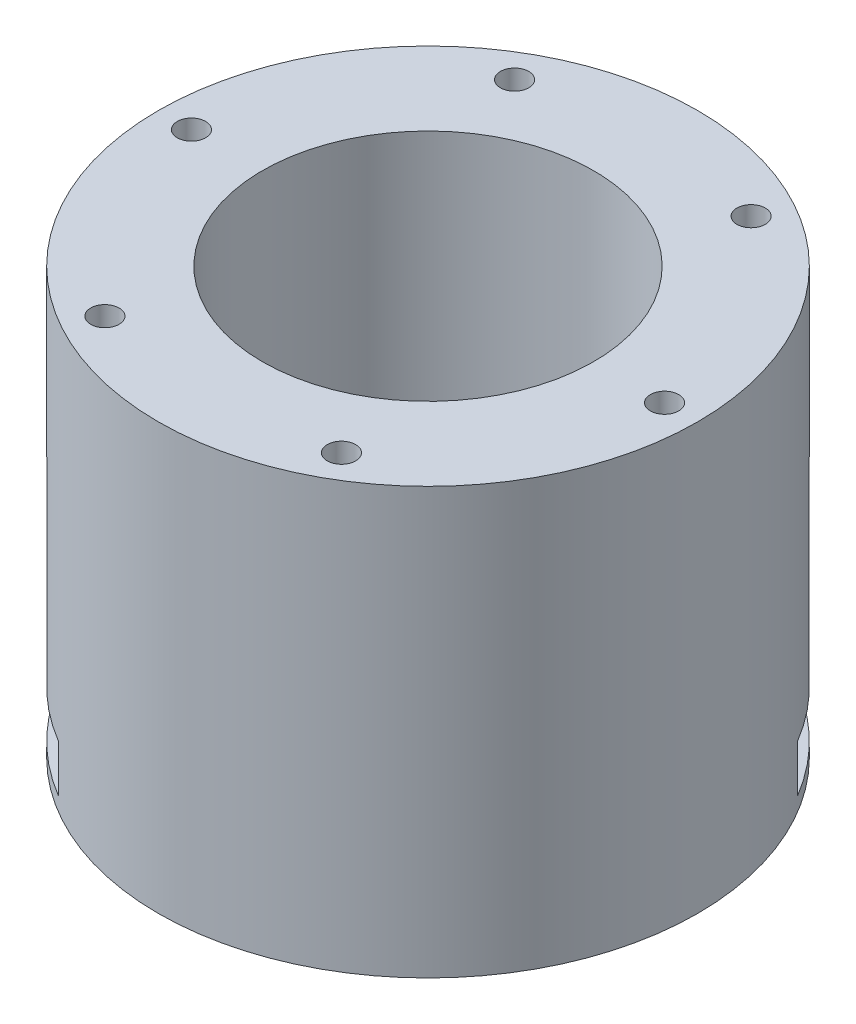
ISO-10303-21;
HEADER;
FILE_DESCRIPTION(('STEP AP214'),'2;1');
FILE_NAME('part.step','',(''),(''),'','','');
FILE_SCHEMA(('AUTOMOTIVE_DESIGN { 1 0 10303 214 1 1 1 1 }'));
ENDSEC;
DATA;
#1=APPLICATION_CONTEXT('core data for automotive mechanical design processes');
#2=APPLICATION_PROTOCOL_DEFINITION('international standard','automotive_design',2000,#1);
#3=PRODUCT_CONTEXT('',#1,'mechanical');
#4=PRODUCT('Part','Part','',(#3));
#5=PRODUCT_RELATED_PRODUCT_CATEGORY('part','',(#4));
#6=PRODUCT_DEFINITION_FORMATION('','',#4);
#7=PRODUCT_DEFINITION_CONTEXT('part definition',#1,'design');
#8=PRODUCT_DEFINITION('design','',#6,#7);
#9=PRODUCT_DEFINITION_SHAPE('','',#8);
#10=(LENGTH_UNIT() NAMED_UNIT(*) SI_UNIT(.MILLI.,.METRE.));
#11=(NAMED_UNIT(*) PLANE_ANGLE_UNIT() SI_UNIT($,.RADIAN.));
#12=(NAMED_UNIT(*) SI_UNIT($,.STERADIAN.) SOLID_ANGLE_UNIT());
#13=UNCERTAINTY_MEASURE_WITH_UNIT(LENGTH_MEASURE(1.E-05),#10,'distance_accuracy_value','');
#14=(GEOMETRIC_REPRESENTATION_CONTEXT(3) GLOBAL_UNCERTAINTY_ASSIGNED_CONTEXT((#13)) GLOBAL_UNIT_ASSIGNED_CONTEXT((#10,
#11,#12)) REPRESENTATION_CONTEXT('',''));
#15=CARTESIAN_POINT('',(0.,0.,0.));
#16=DIRECTION('',(0.,0.,1.));
#17=DIRECTION('',(1.,0.,0.));
#18=AXIS2_PLACEMENT_3D('',#15,#16,#17);
#19=CARTESIAN_POINT('',(-36.7695526217003,6.5,26.870057685089));
#20=DIRECTION('',(0.707106781186551,0.,0.707106781186544));
#21=DIRECTION('',(0.707106781186544,0.,-0.707106781186551));
#22=AXIS2_PLACEMENT_3D('',#19,#20,#21);
#23=PLANE('',#22);
#24=DIRECTION('',(0.707106781186544,0.,-0.707106781186551));
#25=VECTOR('',#24,1.);
#26=CARTESIAN_POINT('',(-36.7695526217003,6.5,26.870057685089));
#27=LINE('',#26,#25);
#28=CARTESIAN_POINT('',(-1.7677669529664,6.5,-8.13172798364529));
#29=VERTEX_POINT('',#28);
#30=CARTESIAN_POINT('',(14.5854771272803,6.5,-24.4849720638922));
#31=VERTEX_POINT('',#30);
#32=EDGE_CURVE('E166',#29,#31,#27,.T.);
#33=ORIENTED_EDGE('',*,*,#32,.F.);
#34=DIRECTION('',(0.,-1.,0.));
#35=VECTOR('',#34,1.);
#36=CARTESIAN_POINT('',(-1.7677669529664,6.5,-8.13172798364529));
#37=LINE('',#36,#35);
#38=CARTESIAN_POINT('',(-1.7677669529664,1.5,-8.13172798364531));
#39=VERTEX_POINT('',#38);
#40=EDGE_CURVE('E144',#29,#39,#37,.T.);
#41=ORIENTED_EDGE('',*,*,#40,.T.);
#42=DIRECTION('',(0.707106781186544,0.,-0.707106781186551));
#43=VECTOR('',#42,1.);
#44=CARTESIAN_POINT('',(-36.7695526217003,1.5,26.870057685089));
#45=LINE('',#44,#43);
#46=CARTESIAN_POINT('',(14.5854771272803,1.50000000000001,-24.4849720638922));
#47=VERTEX_POINT('',#46);
#48=EDGE_CURVE('E170',#39,#47,#45,.T.);
#49=ORIENTED_EDGE('',*,*,#48,.T.);
#50=DIRECTION('',(0.,-1.,0.));
#51=VECTOR('',#50,1.);
#52=CARTESIAN_POINT('',(14.5854771272804,45.,-24.4849720638922));
#53=LINE('',#52,#51);
#54=EDGE_CURVE('E216',#47,#31,#53,.F.);
#55=ORIENTED_EDGE('',*,*,#54,.T.);
#56=EDGE_LOOP('',(#33,#41,#49,#55));
#57=FACE_BOUND('',#56,.T.);
#58=ADVANCED_FACE('F35',(#57),#23,.T.);
#59=CARTESIAN_POINT('',(0.,45.,0.));
#60=DIRECTION('',(0.,-1.,0.));
#61=DIRECTION('',(0.,0.,-1.));
#62=AXIS2_PLACEMENT_3D('',#59,#60,#61);
#63=CYLINDRICAL_SURFACE('',#62,28.5);
#64=CARTESIAN_POINT('',(0.,8.50000000000001,0.));
#65=DIRECTION('',(0.,-1.,0.));
#66=DIRECTION('',(0.,0.,-1.));
#67=AXIS2_PLACEMENT_3D('',#64,#65,#66);
#68=CIRCLE('',#67,28.5);
#69=CARTESIAN_POINT('',(-23.0817292574719,8.50000000000001,-16.7177682267929));
#70=VERTEX_POINT('',#69);
#71=CARTESIAN_POINT('',(-16.717768226793,8.5,-23.0817292574718));
#72=VERTEX_POINT('',#71);
#73=EDGE_CURVE('E11',#70,#72,#68,.T.);
#74=ORIENTED_EDGE('',*,*,#73,.F.);
#75=DIRECTION('',(0.,-1.,0.));
#76=VECTOR('',#75,1.);
#77=CARTESIAN_POINT('',(-23.0817292574719,45.,-16.7177682267929));
#78=LINE('',#77,#76);
#79=CARTESIAN_POINT('',(-23.0817292574719,1.50000000000001,-16.7177682267929));
#80=VERTEX_POINT('',#79);
#81=EDGE_CURVE('E155',#70,#80,#78,.T.);
#82=ORIENTED_EDGE('',*,*,#81,.T.);
#83=CARTESIAN_POINT('',(0.,1.50000000000001,0.));
#84=DIRECTION('',(0.,-1.,0.));
#85=DIRECTION('',(0.,0.,-1.));
#86=AXIS2_PLACEMENT_3D('',#83,#84,#85);
#87=CIRCLE('',#86,28.5);
#88=CARTESIAN_POINT('',(-16.717768226793,1.50000000000001,-23.0817292574718));
#89=VERTEX_POINT('',#88);
#90=EDGE_CURVE('E158',#80,#89,#87,.T.);
#91=ORIENTED_EDGE('',*,*,#90,.T.);
#92=DIRECTION('',(0.,-1.,0.));
#93=VECTOR('',#92,1.);
#94=CARTESIAN_POINT('',(-16.717768226793,45.,-23.0817292574718));
#95=LINE('',#94,#93);
#96=EDGE_CURVE('E148',#72,#89,#95,.T.);
#97=ORIENTED_EDGE('',*,*,#96,.F.);
#98=EDGE_LOOP('',(#74,#82,#91,#97));
#99=FACE_BOUND('',#98,.T.);
#100=DIRECTION('',(0.,-1.,0.));
#101=VECTOR('',#100,1.);
#102=CARTESIAN_POINT('',(-24.484972063892,45.,14.5854771272806));
#103=LINE('',#102,#101);
#104=CARTESIAN_POINT('',(-24.4849720638921,6.5,14.5854771272806));
#105=VERTEX_POINT('',#104);
#106=CARTESIAN_POINT('',(-24.4849720638921,1.50000000000001,14.5854771272806));
#107=VERTEX_POINT('',#106);
#108=EDGE_CURVE('E225',#105,#107,#103,.T.);
#109=ORIENTED_EDGE('',*,*,#108,.F.);
#110=CARTESIAN_POINT('',(0.,6.50000000000001,0.));
#111=DIRECTION('',(0.,1.,0.));
#112=DIRECTION('',(-1.,0.,0.));
#113=AXIS2_PLACEMENT_3D('',#110,#111,#112);
#114=CIRCLE('',#113,28.5);
#115=CARTESIAN_POINT('',(-14.5854771272803,6.5,24.4849720638922));
#116=VERTEX_POINT('',#115);
#117=EDGE_CURVE('E43',#105,#116,#114,.T.);
#118=ORIENTED_EDGE('',*,*,#117,.T.);
#119=DIRECTION('',(0.,-1.,0.));
#120=VECTOR('',#119,1.);
#121=CARTESIAN_POINT('',(-14.5854771272803,45.,24.4849720638922));
#122=LINE('',#121,#120);
#123=CARTESIAN_POINT('',(-14.5854771272803,1.5,24.4849720638922));
#124=VERTEX_POINT('',#123);
#125=EDGE_CURVE('E223',#116,#124,#122,.T.);
#126=ORIENTED_EDGE('',*,*,#125,.T.);
#127=CARTESIAN_POINT('',(0.,1.50000000000001,0.));
#128=DIRECTION('',(0.,1.,0.));
#129=DIRECTION('',(-1.,0.,0.));
#130=AXIS2_PLACEMENT_3D('',#127,#128,#129);
#131=CIRCLE('',#130,28.5);
#132=EDGE_CURVE('E217',#107,#124,#131,.T.);
#133=ORIENTED_EDGE('',*,*,#132,.F.);
#134=EDGE_LOOP('',(#109,#118,#126,#133));
#135=FACE_BOUND('',#134,.T.);
#136=DIRECTION('',(0.,-1.,0.));
#137=VECTOR('',#136,1.);
#138=CARTESIAN_POINT('',(24.4849720638921,45.,-14.5854771272806));
#139=LINE('',#138,#137);
#140=CARTESIAN_POINT('',(24.484972063892,1.5,-14.5854771272806));
#141=VERTEX_POINT('',#140);
#142=CARTESIAN_POINT('',(24.4849720638921,6.5,-14.5854771272806));
#143=VERTEX_POINT('',#142);
#144=EDGE_CURVE('E208',#141,#143,#139,.F.);
#145=ORIENTED_EDGE('',*,*,#144,.T.);
#146=EDGE_CURVE('E220',#143,#31,#114,.T.);
#147=ORIENTED_EDGE('',*,*,#146,.T.);
#148=ORIENTED_EDGE('',*,*,#54,.F.);
#149=EDGE_CURVE('E213',#141,#47,#131,.T.);
#150=ORIENTED_EDGE('',*,*,#149,.F.);
#151=EDGE_LOOP('',(#145,#147,#148,#150));
#152=FACE_BOUND('',#151,.T.);
#153=CARTESIAN_POINT('',(0.,45.,0.));
#154=DIRECTION('',(0.,1.,0.));
#155=DIRECTION('',(0.,0.,1.));
#156=AXIS2_PLACEMENT_3D('',#153,#154,#155);
#157=CIRCLE('',#156,28.5);
#158=CARTESIAN_POINT('',(0.,45.,28.5));
#159=VERTEX_POINT('',#158);
#160=EDGE_CURVE('E205',#159,#159,#157,.T.);
#161=ORIENTED_EDGE('',*,*,#160,.F.);
#162=EDGE_LOOP('',(#161));
#163=FACE_BOUND('',#162,.T.);
#164=CARTESIAN_POINT('',(0.,0.,0.));
#165=DIRECTION('',(0.,1.,0.));
#166=DIRECTION('',(0.,0.,1.));
#167=AXIS2_PLACEMENT_3D('',#164,#165,#166);
#168=CIRCLE('',#167,28.5);
#169=CARTESIAN_POINT('',(0.,0.,28.5));
#170=VERTEX_POINT('',#169);
#171=EDGE_CURVE('E202',#170,#170,#168,.T.);
#172=ORIENTED_EDGE('',*,*,#171,.T.);
#173=EDGE_LOOP('',(#172));
#174=FACE_BOUND('',#173,.T.);
#175=ADVANCED_FACE('F37',(#99,#135,#152,#163,#174),#63,.T.);
#176=CARTESIAN_POINT('',(0.,45.,0.));
#177=DIRECTION('',(0.,1.,0.));
#178=DIRECTION('',(0.,0.,1.));
#179=AXIS2_PLACEMENT_3D('',#176,#177,#178);
#180=PLANE('',#179);
#181=CARTESIAN_POINT('',(-12.4999999999996,45.,-21.6506350946112));
#182=DIRECTION('',(0.,1.,0.));
#183=DIRECTION('',(0.,0.,1.));
#184=AXIS2_PLACEMENT_3D('',#181,#182,#183);
#185=CIRCLE('',#184,1.5);
#186=CARTESIAN_POINT('',(-12.4999999999996,45.,-20.1506350946112));
#187=VERTEX_POINT('',#186);
#188=EDGE_CURVE('E392',#187,#187,#185,.T.);
#189=ORIENTED_EDGE('',*,*,#188,.F.);
#190=EDGE_LOOP('',(#189));
#191=FACE_BOUND('',#190,.T.);
#192=CARTESIAN_POINT('',(12.5000000000001,45.,-21.6506350946109));
#193=DIRECTION('',(0.,1.,0.));
#194=DIRECTION('',(0.,0.,1.));
#195=AXIS2_PLACEMENT_3D('',#192,#193,#194);
#196=CIRCLE('',#195,1.5);
#197=CARTESIAN_POINT('',(12.5000000000001,45.,-20.1506350946109));
#198=VERTEX_POINT('',#197);
#199=EDGE_CURVE('E401',#198,#198,#196,.T.);
#200=ORIENTED_EDGE('',*,*,#199,.F.);
#201=EDGE_LOOP('',(#200));
#202=FACE_BOUND('',#201,.T.);
#203=CARTESIAN_POINT('',(25.,45.,1.74574066942157E-13));
#204=DIRECTION('',(0.,1.,0.));
#205=DIRECTION('',(0.,0.,1.));
#206=AXIS2_PLACEMENT_3D('',#203,#204,#205);
#207=CIRCLE('',#206,1.5);
#208=CARTESIAN_POINT('',(25.,45.,1.50000000000018));
#209=VERTEX_POINT('',#208);
#210=EDGE_CURVE('E407',#209,#209,#207,.T.);
#211=ORIENTED_EDGE('',*,*,#210,.F.);
#212=EDGE_LOOP('',(#211));
#213=FACE_BOUND('',#212,.T.);
#214=CARTESIAN_POINT('',(12.4999999999998,45.,21.6506350946111));
#215=DIRECTION('',(0.,1.,0.));
#216=DIRECTION('',(0.,0.,1.));
#217=AXIS2_PLACEMENT_3D('',#214,#215,#216);
#218=CIRCLE('',#217,1.5);
#219=CARTESIAN_POINT('',(12.4999999999998,45.,23.1506350946111));
#220=VERTEX_POINT('',#219);
#221=EDGE_CURVE('E413',#220,#220,#218,.T.);
#222=ORIENTED_EDGE('',*,*,#221,.F.);
#223=EDGE_LOOP('',(#222));
#224=FACE_BOUND('',#223,.T.);
#225=CARTESIAN_POINT('',(-12.5000000000003,45.,21.6506350946108));
#226=DIRECTION('',(0.,1.,0.));
#227=DIRECTION('',(0.,0.,1.));
#228=AXIS2_PLACEMENT_3D('',#225,#226,#227);
#229=CIRCLE('',#228,1.5);
#230=CARTESIAN_POINT('',(-12.5000000000003,45.,23.1506350946108));
#231=VERTEX_POINT('',#230);
#232=EDGE_CURVE('E419',#231,#231,#229,.T.);
#233=ORIENTED_EDGE('',*,*,#232,.F.);
#234=EDGE_LOOP('',(#233));
#235=FACE_BOUND('',#234,.T.);
#236=CARTESIAN_POINT('',(-25.,45.,0.));
#237=DIRECTION('',(0.,1.,0.));
#238=DIRECTION('',(0.,0.,1.));
#239=AXIS2_PLACEMENT_3D('',#236,#237,#238);
#240=CIRCLE('',#239,1.5);
#241=CARTESIAN_POINT('',(-25.,45.,1.5));
#242=VERTEX_POINT('',#241);
#243=EDGE_CURVE('E391',#242,#242,#240,.T.);
#244=ORIENTED_EDGE('',*,*,#243,.F.);
#245=EDGE_LOOP('',(#244));
#246=FACE_BOUND('',#245,.T.);
#247=CARTESIAN_POINT('',(0.,45.,0.));
#248=DIRECTION('',(0.,1.,0.));
#249=DIRECTION('',(0.,0.,1.));
#250=AXIS2_PLACEMENT_3D('',#247,#248,#249);
#251=CIRCLE('',#250,17.5);
#252=CARTESIAN_POINT('',(0.,45.,17.5));
#253=VERTEX_POINT('',#252);
#254=EDGE_CURVE('E196',#253,#253,#251,.T.);
#255=ORIENTED_EDGE('',*,*,#254,.F.);
#256=EDGE_LOOP('',(#255));
#257=FACE_BOUND('',#256,.T.);
#258=ORIENTED_EDGE('',*,*,#160,.T.);
#259=EDGE_LOOP('',(#258));
#260=FACE_BOUND('',#259,.T.);
#261=ADVANCED_FACE('F265',(#191,#202,#213,#224,#235,#246,#257,#260),#180,.T.);
#262=CARTESIAN_POINT('',(0.,0.,0.));
#263=DIRECTION('',(0.,1.,0.));
#264=DIRECTION('',(0.,0.,1.));
#265=AXIS2_PLACEMENT_3D('',#262,#263,#264);
#266=PLANE('',#265);
#267=CARTESIAN_POINT('',(0.,0.,19.));
#268=DIRECTION('',(0.,-1.,0.));
#269=DIRECTION('',(0.,0.,-1.));
#270=AXIS2_PLACEMENT_3D('',#267,#268,#269);
#271=CIRCLE('',#270,1.5);
#272=CARTESIAN_POINT('',(0.,0.,17.5));
#273=VERTEX_POINT('',#272);
#274=EDGE_CURVE('E179',#273,#273,#271,.T.);
#275=ORIENTED_EDGE('',*,*,#274,.F.);
#276=EDGE_LOOP('',(#275));
#277=FACE_BOUND('',#276,.T.);
#278=CARTESIAN_POINT('',(19.,0.,-1.32676290876039E-13));
#279=DIRECTION('',(0.,-1.,0.));
#280=DIRECTION('',(0.,0.,-1.));
#281=AXIS2_PLACEMENT_3D('',#278,#279,#280);
#282=CIRCLE('',#281,1.5);
#283=CARTESIAN_POINT('',(19.,0.,-1.50000000000013));
#284=VERTEX_POINT('',#283);
#285=EDGE_CURVE('E185',#284,#284,#282,.T.);
#286=ORIENTED_EDGE('',*,*,#285,.F.);
#287=EDGE_LOOP('',(#286));
#288=FACE_BOUND('',#287,.T.);
#289=CARTESIAN_POINT('',(-1.99014436314059E-13,0.,-19.));
#290=DIRECTION('',(0.,-1.,0.));
#291=DIRECTION('',(0.,0.,-1.));
#292=AXIS2_PLACEMENT_3D('',#289,#290,#291);
#293=CIRCLE('',#292,1.5);
#294=CARTESIAN_POINT('',(-1.99014436314059E-13,0.,-20.5));
#295=VERTEX_POINT('',#294);
#296=EDGE_CURVE('E165',#295,#295,#293,.T.);
#297=ORIENTED_EDGE('',*,*,#296,.F.);
#298=EDGE_LOOP('',(#297));
#299=FACE_BOUND('',#298,.T.);
#300=CARTESIAN_POINT('',(-19.,0.,0.));
#301=DIRECTION('',(0.,-1.,0.));
#302=DIRECTION('',(0.,0.,-1.));
#303=AXIS2_PLACEMENT_3D('',#300,#301,#302);
#304=CIRCLE('',#303,1.5);
#305=CARTESIAN_POINT('',(-19.,0.,-1.5));
#306=VERTEX_POINT('',#305);
#307=EDGE_CURVE('E178',#306,#306,#304,.T.);
#308=ORIENTED_EDGE('',*,*,#307,.F.);
#309=EDGE_LOOP('',(#308));
#310=FACE_BOUND('',#309,.T.);
#311=ORIENTED_EDGE('',*,*,#171,.F.);
#312=EDGE_LOOP('',(#311));
#313=FACE_BOUND('',#312,.T.);
#314=ADVANCED_FACE('F269',(#277,#288,#299,#310,#313),#266,.F.);
#315=CARTESIAN_POINT('',(0.,15.,0.));
#316=DIRECTION('',(0.,1.,0.));
#317=DIRECTION('',(0.,0.,1.));
#318=AXIS2_PLACEMENT_3D('',#315,#316,#317);
#319=CYLINDRICAL_SURFACE('',#318,17.5);
#320=CARTESIAN_POINT('',(0.,15.,0.));
#321=DIRECTION('',(0.,1.,0.));
#322=DIRECTION('',(0.,0.,1.));
#323=AXIS2_PLACEMENT_3D('',#320,#321,#322);
#324=CIRCLE('',#323,17.5);
#325=CARTESIAN_POINT('',(0.,15.,17.5));
#326=VERTEX_POINT('',#325);
#327=EDGE_CURVE('E199',#326,#326,#324,.T.);
#328=ORIENTED_EDGE('',*,*,#327,.F.);
#329=EDGE_LOOP('',(#328));
#330=FACE_BOUND('',#329,.T.);
#331=ORIENTED_EDGE('',*,*,#254,.T.);
#332=EDGE_LOOP('',(#331));
#333=FACE_BOUND('',#332,.T.);
#334=ADVANCED_FACE('F275',(#330,#333),#319,.F.);
#335=CARTESIAN_POINT('',(0.,15.,0.));
#336=DIRECTION('',(0.,1.,0.));
#337=DIRECTION('',(0.,0.,1.));
#338=AXIS2_PLACEMENT_3D('',#335,#336,#337);
#339=PLANE('',#338);
#340=ORIENTED_EDGE('',*,*,#327,.T.);
#341=EDGE_LOOP('',(#340));
#342=FACE_BOUND('',#341,.T.);
#343=ADVANCED_FACE('F282',(#342),#339,.T.);
#344=CARTESIAN_POINT('',(-19.,6.,0.));
#345=DIRECTION('',(0.,-1.,0.));
#346=DIRECTION('',(0.,0.,-1.));
#347=AXIS2_PLACEMENT_3D('',#344,#345,#346);
#348=CYLINDRICAL_SURFACE('',#347,1.5);
#349=CARTESIAN_POINT('',(-19.,6.,0.));
#350=DIRECTION('',(0.,-1.,0.));
#351=DIRECTION('',(0.,0.,-1.));
#352=AXIS2_PLACEMENT_3D('',#349,#350,#351);
#353=CIRCLE('',#352,1.5);
#354=CARTESIAN_POINT('',(-19.,6.,-1.5));
#355=VERTEX_POINT('',#354);
#356=EDGE_CURVE('E193',#355,#355,#353,.T.);
#357=ORIENTED_EDGE('',*,*,#356,.F.);
#358=EDGE_LOOP('',(#357));
#359=FACE_BOUND('',#358,.T.);
#360=ORIENTED_EDGE('',*,*,#307,.T.);
#361=EDGE_LOOP('',(#360));
#362=FACE_BOUND('',#361,.T.);
#363=ADVANCED_FACE('F286',(#359,#362),#348,.F.);
#364=CARTESIAN_POINT('',(-19.,6.,0.));
#365=DIRECTION('',(0.,-1.,0.));
#366=DIRECTION('',(0.,0.,-1.));
#367=AXIS2_PLACEMENT_3D('',#364,#365,#366);
#368=PLANE('',#367);
#369=ORIENTED_EDGE('',*,*,#356,.T.);
#370=EDGE_LOOP('',(#369));
#371=FACE_BOUND('',#370,.T.);
#372=ADVANCED_FACE('F290',(#371),#368,.T.);
#373=CARTESIAN_POINT('',(-1.99014436314059E-13,6.,-19.));
#374=DIRECTION('',(0.,-1.,0.));
#375=DIRECTION('',(0.,0.,-1.));
#376=AXIS2_PLACEMENT_3D('',#373,#374,#375);
#377=CYLINDRICAL_SURFACE('',#376,1.5);
#378=CARTESIAN_POINT('',(-1.99014436314059E-13,6.,-19.));
#379=DIRECTION('',(0.,-1.,0.));
#380=DIRECTION('',(0.,0.,-1.));
#381=AXIS2_PLACEMENT_3D('',#378,#379,#380);
#382=CIRCLE('',#381,1.5);
#383=CARTESIAN_POINT('',(-1.99014436314059E-13,6.,-20.5));
#384=VERTEX_POINT('',#383);
#385=EDGE_CURVE('E188',#384,#384,#382,.T.);
#386=ORIENTED_EDGE('',*,*,#385,.F.);
#387=EDGE_LOOP('',(#386));
#388=FACE_BOUND('',#387,.T.);
#389=ORIENTED_EDGE('',*,*,#296,.T.);
#390=EDGE_LOOP('',(#389));
#391=FACE_BOUND('',#390,.T.);
#392=ADVANCED_FACE('F294',(#388,#391),#377,.F.);
#393=CARTESIAN_POINT('',(-1.99014436314059E-13,6.,-19.));
#394=DIRECTION('',(0.,-1.,0.));
#395=DIRECTION('',(0.,0.,-1.));
#396=AXIS2_PLACEMENT_3D('',#393,#394,#395);
#397=PLANE('',#396);
#398=ORIENTED_EDGE('',*,*,#385,.T.);
#399=EDGE_LOOP('',(#398));
#400=FACE_BOUND('',#399,.T.);
#401=ADVANCED_FACE('F298',(#400),#397,.T.);
#402=CARTESIAN_POINT('',(19.,6.,-1.32676290876039E-13));
#403=DIRECTION('',(0.,-1.,0.));
#404=DIRECTION('',(0.,0.,-1.));
#405=AXIS2_PLACEMENT_3D('',#402,#403,#404);
#406=CYLINDRICAL_SURFACE('',#405,1.5);
#407=CARTESIAN_POINT('',(19.,6.,-1.32676290876039E-13));
#408=DIRECTION('',(0.,-1.,0.));
#409=DIRECTION('',(0.,0.,-1.));
#410=AXIS2_PLACEMENT_3D('',#407,#408,#409);
#411=CIRCLE('',#410,1.5);
#412=CARTESIAN_POINT('',(19.,6.,-1.50000000000013));
#413=VERTEX_POINT('',#412);
#414=EDGE_CURVE('E182',#413,#413,#411,.T.);
#415=ORIENTED_EDGE('',*,*,#414,.F.);
#416=EDGE_LOOP('',(#415));
#417=FACE_BOUND('',#416,.T.);
#418=ORIENTED_EDGE('',*,*,#285,.T.);
#419=EDGE_LOOP('',(#418));
#420=FACE_BOUND('',#419,.T.);
#421=ADVANCED_FACE('F302',(#417,#420),#406,.F.);
#422=CARTESIAN_POINT('',(19.,6.,-1.32676290876039E-13));
#423=DIRECTION('',(0.,-1.,0.));
#424=DIRECTION('',(0.,0.,-1.));
#425=AXIS2_PLACEMENT_3D('',#422,#423,#424);
#426=PLANE('',#425);
#427=ORIENTED_EDGE('',*,*,#414,.T.);
#428=EDGE_LOOP('',(#427));
#429=FACE_BOUND('',#428,.T.);
#430=ADVANCED_FACE('F306',(#429),#426,.T.);
#431=CARTESIAN_POINT('',(0.,6.,19.));
#432=DIRECTION('',(0.,-1.,0.));
#433=DIRECTION('',(0.,0.,-1.));
#434=AXIS2_PLACEMENT_3D('',#431,#432,#433);
#435=CYLINDRICAL_SURFACE('',#434,1.5);
#436=CARTESIAN_POINT('',(0.,6.,19.));
#437=DIRECTION('',(0.,-1.,0.));
#438=DIRECTION('',(0.,0.,-1.));
#439=AXIS2_PLACEMENT_3D('',#436,#437,#438);
#440=CIRCLE('',#439,1.5);
#441=CARTESIAN_POINT('',(0.,6.,17.5));
#442=VERTEX_POINT('',#441);
#443=EDGE_CURVE('E175',#442,#442,#440,.T.);
#444=ORIENTED_EDGE('',*,*,#443,.F.);
#445=EDGE_LOOP('',(#444));
#446=FACE_BOUND('',#445,.T.);
#447=ORIENTED_EDGE('',*,*,#274,.T.);
#448=EDGE_LOOP('',(#447));
#449=FACE_BOUND('',#448,.T.);
#450=ADVANCED_FACE('F310',(#446,#449),#435,.F.);
#451=CARTESIAN_POINT('',(0.,6.,19.));
#452=DIRECTION('',(0.,-1.,0.));
#453=DIRECTION('',(0.,0.,-1.));
#454=AXIS2_PLACEMENT_3D('',#451,#452,#453);
#455=PLANE('',#454);
#456=ORIENTED_EDGE('',*,*,#443,.T.);
#457=EDGE_LOOP('',(#456));
#458=FACE_BOUND('',#457,.T.);
#459=ADVANCED_FACE('F258',(#458),#455,.T.);
#460=CARTESIAN_POINT('',(-36.7695526217003,6.5,26.870057685089));
#461=DIRECTION('',(0.,1.,0.));
#462=DIRECTION('',(-1.,0.,0.));
#463=AXIS2_PLACEMENT_3D('',#460,#461,#462);
#464=PLANE('',#463);
#465=CARTESIAN_POINT('',(-8.13172798364529,6.5,-1.76776695296634));
#466=VERTEX_POINT('',#465);
#467=EDGE_CURVE('E162',#105,#466,#27,.T.);
#468=ORIENTED_EDGE('',*,*,#467,.T.);
#469=DIRECTION('',(0.707106781186549,0.,0.707106781186546));
#470=VECTOR('',#469,1.);
#471=CARTESIAN_POINT('',(-8.13172798364519,6.5,-1.76776695296624));
#472=LINE('',#471,#470);
#473=CARTESIAN_POINT('',(-3.18198051533946,6.5,3.18198051533947));
#474=VERTEX_POINT('',#473);
#475=EDGE_CURVE('E152',#466,#474,#472,.T.);
#476=ORIENTED_EDGE('',*,*,#475,.T.);
#477=DIRECTION('',(0.707106781186546,0.,-0.707106781186549));
#478=VECTOR('',#477,1.);
#479=CARTESIAN_POINT('',(-31.8198051533946,6.5,31.8198051533947));
#480=LINE('',#479,#478);
#481=CARTESIAN_POINT('',(3.18198051533946,6.5,-3.18198051533947));
#482=VERTEX_POINT('',#481);
#483=EDGE_CURVE('E139',#474,#482,#480,.T.);
#484=ORIENTED_EDGE('',*,*,#483,.T.);
#485=DIRECTION('',(0.707106781186549,0.,0.707106781186546));
#486=VECTOR('',#485,1.);
#487=CARTESIAN_POINT('',(-1.76776695296628,6.5,-8.13172798364517));
#488=LINE('',#487,#486);
#489=EDGE_CURVE('E133',#29,#482,#488,.T.);
#490=ORIENTED_EDGE('',*,*,#489,.F.);
#491=ORIENTED_EDGE('',*,*,#32,.T.);
#492=ORIENTED_EDGE('',*,*,#146,.F.);
#493=DIRECTION('',(0.707106781186544,0.,-0.707106781186551));
#494=VECTOR('',#493,1.);
#495=CARTESIAN_POINT('',(-26.8700576850886,6.5,36.7695526217006));
#496=LINE('',#495,#494);
#497=EDGE_CURVE('E161',#116,#143,#496,.T.);
#498=ORIENTED_EDGE('',*,*,#497,.F.);
#499=ORIENTED_EDGE('',*,*,#117,.F.);
#500=EDGE_LOOP('',(#468,#476,#484,#490,#491,#492,#498,#499));
#501=FACE_BOUND('',#500,.T.);
#502=ADVANCED_FACE('F241',(#501),#464,.F.);
#503=DIRECTION('',(0.,-1.,0.));
#504=VECTOR('',#503,1.);
#505=CARTESIAN_POINT('',(-8.13172798364529,6.50000000000001,-1.76776695296634));
#506=LINE('',#505,#504);
#507=CARTESIAN_POINT('',(-8.13172798364529,1.5,-1.76776695296633));
#508=VERTEX_POINT('',#507);
#509=EDGE_CURVE('E150',#466,#508,#506,.T.);
#510=ORIENTED_EDGE('',*,*,#509,.F.);
#511=ORIENTED_EDGE('',*,*,#467,.F.);
#512=ORIENTED_EDGE('',*,*,#108,.T.);
#513=EDGE_CURVE('E167',#107,#508,#45,.T.);
#514=ORIENTED_EDGE('',*,*,#513,.T.);
#515=EDGE_LOOP('',(#510,#511,#512,#514));
#516=FACE_BOUND('',#515,.T.);
#517=ADVANCED_FACE('F250',(#516),#23,.T.);
#518=CARTESIAN_POINT('',(-36.7695526217003,1.5,26.870057685089));
#519=DIRECTION('',(0.,1.,0.));
#520=DIRECTION('',(-1.,0.,0.));
#521=AXIS2_PLACEMENT_3D('',#518,#519,#520);
#522=PLANE('',#521);
#523=ORIENTED_EDGE('',*,*,#48,.F.);
#524=DIRECTION('',(0.707106781186549,0.,0.707106781186546));
#525=VECTOR('',#524,1.);
#526=CARTESIAN_POINT('',(-60.4576297914499,1.5,-66.8215908221286));
#527=LINE('',#526,#525);
#528=EDGE_CURVE('E50',#89,#39,#527,.T.);
#529=ORIENTED_EDGE('',*,*,#528,.F.);
#530=ORIENTED_EDGE('',*,*,#90,.F.);
#531=DIRECTION('',(0.707106781186549,0.,0.707106781186546));
#532=VECTOR('',#531,1.);
#533=CARTESIAN_POINT('',(-66.8215908221288,1.5,-60.4576297914497));
#534=LINE('',#533,#532);
#535=EDGE_CURVE('E56',#80,#508,#534,.T.);
#536=ORIENTED_EDGE('',*,*,#535,.T.);
#537=ORIENTED_EDGE('',*,*,#513,.F.);
#538=ORIENTED_EDGE('',*,*,#132,.T.);
#539=DIRECTION('',(0.707106781186544,0.,-0.707106781186551));
#540=VECTOR('',#539,1.);
#541=CARTESIAN_POINT('',(-26.8700576850886,1.5,36.7695526217006));
#542=LINE('',#541,#540);
#543=EDGE_CURVE('E171',#124,#141,#542,.T.);
#544=ORIENTED_EDGE('',*,*,#543,.T.);
#545=ORIENTED_EDGE('',*,*,#149,.T.);
#546=EDGE_LOOP('',(#523,#529,#530,#536,#537,#538,#544,#545));
#547=FACE_BOUND('',#546,.T.);
#548=ADVANCED_FACE('F232',(#547),#522,.T.);
#549=CARTESIAN_POINT('',(-26.8700576850886,6.5,36.7695526217006));
#550=DIRECTION('',(0.707106781186551,0.,0.707106781186544));
#551=DIRECTION('',(0.707106781186544,0.,-0.707106781186551));
#552=AXIS2_PLACEMENT_3D('',#549,#550,#551);
#553=PLANE('',#552);
#554=ORIENTED_EDGE('',*,*,#497,.T.);
#555=ORIENTED_EDGE('',*,*,#144,.F.);
#556=ORIENTED_EDGE('',*,*,#543,.F.);
#557=ORIENTED_EDGE('',*,*,#125,.F.);
#558=EDGE_LOOP('',(#554,#555,#556,#557));
#559=FACE_BOUND('',#558,.T.);
#560=ADVANCED_FACE('F238',(#559),#553,.F.);
#561=CARTESIAN_POINT('',(-66.8215908221288,8.5,-60.4576297914497));
#562=DIRECTION('',(0.,-1.,0.));
#563=DIRECTION('',(0.,0.,-1.));
#564=AXIS2_PLACEMENT_3D('',#561,#562,#563);
#565=PLANE('',#564);
#566=ORIENTED_EDGE('',*,*,#73,.T.);
#567=DIRECTION('',(0.707106781186549,0.,0.707106781186546));
#568=VECTOR('',#567,1.);
#569=CARTESIAN_POINT('',(-60.4576297914499,8.5,-66.8215908221286));
#570=LINE('',#569,#568);
#571=CARTESIAN_POINT('',(3.18198051533946,8.5,-3.18198051533947));
#572=VERTEX_POINT('',#571);
#573=EDGE_CURVE('E111',#72,#572,#570,.T.);
#574=ORIENTED_EDGE('',*,*,#573,.T.);
#575=DIRECTION('',(0.707106781186546,0.,-0.707106781186549));
#576=VECTOR('',#575,1.);
#577=CARTESIAN_POINT('',(-3.18198051533946,8.5,3.18198051533947));
#578=LINE('',#577,#576);
#579=CARTESIAN_POINT('',(-3.18198051533946,8.5,3.18198051533947));
#580=VERTEX_POINT('',#579);
#581=EDGE_CURVE('E115',#580,#572,#578,.T.);
#582=ORIENTED_EDGE('',*,*,#581,.F.);
#583=DIRECTION('',(0.707106781186549,0.,0.707106781186546));
#584=VECTOR('',#583,1.);
#585=CARTESIAN_POINT('',(-66.8215908221288,8.5,-60.4576297914497));
#586=LINE('',#585,#584);
#587=EDGE_CURVE('E121',#70,#580,#586,.T.);
#588=ORIENTED_EDGE('',*,*,#587,.F.);
#589=EDGE_LOOP('',(#566,#574,#582,#588));
#590=FACE_BOUND('',#589,.T.);
#591=ADVANCED_FACE('F113',(#590),#565,.T.);
#592=CARTESIAN_POINT('',(-66.8215908221288,8.5,-60.4576297914497));
#593=DIRECTION('',(-0.707106781186546,0.,0.707106781186549));
#594=DIRECTION('',(0.707106781186549,0.,0.707106781186546));
#595=AXIS2_PLACEMENT_3D('',#592,#593,#594);
#596=PLANE('',#595);
#597=ORIENTED_EDGE('',*,*,#587,.T.);
#598=DIRECTION('',(0.,-1.,0.));
#599=VECTOR('',#598,1.);
#600=CARTESIAN_POINT('',(-3.18198051533946,8.5,3.18198051533947));
#601=LINE('',#600,#599);
#602=EDGE_CURVE('E129',#580,#474,#601,.T.);
#603=ORIENTED_EDGE('',*,*,#602,.T.);
#604=ORIENTED_EDGE('',*,*,#475,.F.);
#605=ORIENTED_EDGE('',*,*,#509,.T.);
#606=ORIENTED_EDGE('',*,*,#535,.F.);
#607=ORIENTED_EDGE('',*,*,#81,.F.);
#608=EDGE_LOOP('',(#597,#603,#604,#605,#606,#607));
#609=FACE_BOUND('',#608,.T.);
#610=ADVANCED_FACE('F247',(#609),#596,.F.);
#611=CARTESIAN_POINT('',(-60.4576297914499,8.5,-66.8215908221286));
#612=DIRECTION('',(-0.707106781186546,0.,0.707106781186549));
#613=DIRECTION('',(0.707106781186549,0.,0.707106781186546));
#614=AXIS2_PLACEMENT_3D('',#611,#612,#613);
#615=PLANE('',#614);
#616=ORIENTED_EDGE('',*,*,#96,.T.);
#617=ORIENTED_EDGE('',*,*,#528,.T.);
#618=ORIENTED_EDGE('',*,*,#40,.F.);
#619=ORIENTED_EDGE('',*,*,#489,.T.);
#620=DIRECTION('',(0.,-1.,0.));
#621=VECTOR('',#620,1.);
#622=CARTESIAN_POINT('',(3.18198051533946,8.5,-3.18198051533947));
#623=LINE('',#622,#621);
#624=EDGE_CURVE('E126',#572,#482,#623,.T.);
#625=ORIENTED_EDGE('',*,*,#624,.F.);
#626=ORIENTED_EDGE('',*,*,#573,.F.);
#627=EDGE_LOOP('',(#616,#617,#618,#619,#625,#626));
#628=FACE_BOUND('',#627,.T.);
#629=ADVANCED_FACE('F131',(#628),#615,.T.);
#630=CARTESIAN_POINT('',(0.,0.,0.));
#631=DIRECTION('',(0.707106781186549,0.,0.707106781186546));
#632=DIRECTION('',(0.707106781186546,0.,-0.707106781186549));
#633=AXIS2_PLACEMENT_3D('',#630,#631,#632);
#634=PLANE('',#633);
#635=ORIENTED_EDGE('',*,*,#602,.F.);
#636=ORIENTED_EDGE('',*,*,#581,.T.);
#637=ORIENTED_EDGE('',*,*,#624,.T.);
#638=ORIENTED_EDGE('',*,*,#483,.F.);
#639=EDGE_LOOP('',(#635,#636,#637,#638));
#640=FACE_BOUND('',#639,.T.);
#641=ADVANCED_FACE('F125',(#640),#634,.F.);
#642=CARTESIAN_POINT('',(-25.,35.,0.));
#643=DIRECTION('',(0.,1.,0.));
#644=DIRECTION('',(0.,0.,1.));
#645=AXIS2_PLACEMENT_3D('',#642,#643,#644);
#646=CYLINDRICAL_SURFACE('',#645,1.5);
#647=CARTESIAN_POINT('',(-25.,35.,0.));
#648=DIRECTION('',(0.,1.,0.));
#649=DIRECTION('',(0.,0.,1.));
#650=AXIS2_PLACEMENT_3D('',#647,#648,#649);
#651=CIRCLE('',#650,1.5);
#652=CARTESIAN_POINT('',(-25.,35.,1.5));
#653=VERTEX_POINT('',#652);
#654=EDGE_CURVE('E135',#653,#653,#651,.T.);
#655=ORIENTED_EDGE('',*,*,#654,.F.);
#656=EDGE_LOOP('',(#655));
#657=FACE_BOUND('',#656,.T.);
#658=ORIENTED_EDGE('',*,*,#243,.T.);
#659=EDGE_LOOP('',(#658));
#660=FACE_BOUND('',#659,.T.);
#661=ADVANCED_FACE('F333',(#657,#660),#646,.F.);
#662=CARTESIAN_POINT('',(-25.,35.,0.));
#663=DIRECTION('',(0.,1.,0.));
#664=DIRECTION('',(0.,0.,1.));
#665=AXIS2_PLACEMENT_3D('',#662,#663,#664);
#666=PLANE('',#665);
#667=ORIENTED_EDGE('',*,*,#654,.T.);
#668=EDGE_LOOP('',(#667));
#669=FACE_BOUND('',#668,.T.);
#670=ADVANCED_FACE('F337',(#669),#666,.T.);
#671=CARTESIAN_POINT('',(-12.5000000000003,35.,21.6506350946108));
#672=DIRECTION('',(0.,1.,0.));
#673=DIRECTION('',(0.,0.,1.));
#674=AXIS2_PLACEMENT_3D('',#671,#672,#673);
#675=CYLINDRICAL_SURFACE('',#674,1.5);
#676=CARTESIAN_POINT('',(-12.5000000000003,35.,21.6506350946108));
#677=DIRECTION('',(0.,1.,0.));
#678=DIRECTION('',(0.,0.,1.));
#679=AXIS2_PLACEMENT_3D('',#676,#677,#678);
#680=CIRCLE('',#679,1.5);
#681=CARTESIAN_POINT('',(-12.5000000000003,35.,23.1506350946108));
#682=VERTEX_POINT('',#681);
#683=EDGE_CURVE('E416',#682,#682,#680,.T.);
#684=ORIENTED_EDGE('',*,*,#683,.F.);
#685=EDGE_LOOP('',(#684));
#686=FACE_BOUND('',#685,.T.);
#687=ORIENTED_EDGE('',*,*,#232,.T.);
#688=EDGE_LOOP('',(#687));
#689=FACE_BOUND('',#688,.T.);
#690=ADVANCED_FACE('F342',(#686,#689),#675,.F.);
#691=CARTESIAN_POINT('',(-12.5000000000003,35.,21.6506350946108));
#692=DIRECTION('',(0.,1.,0.));
#693=DIRECTION('',(0.,0.,1.));
#694=AXIS2_PLACEMENT_3D('',#691,#692,#693);
#695=PLANE('',#694);
#696=ORIENTED_EDGE('',*,*,#683,.T.);
#697=EDGE_LOOP('',(#696));
#698=FACE_BOUND('',#697,.T.);
#699=ADVANCED_FACE('F350',(#698),#695,.T.);
#700=CARTESIAN_POINT('',(12.4999999999998,35.,21.6506350946111));
#701=DIRECTION('',(0.,1.,0.));
#702=DIRECTION('',(0.,0.,1.));
#703=AXIS2_PLACEMENT_3D('',#700,#701,#702);
#704=CYLINDRICAL_SURFACE('',#703,1.5);
#705=CARTESIAN_POINT('',(12.4999999999998,35.,21.6506350946111));
#706=DIRECTION('',(0.,1.,0.));
#707=DIRECTION('',(0.,0.,1.));
#708=AXIS2_PLACEMENT_3D('',#705,#706,#707);
#709=CIRCLE('',#708,1.5);
#710=CARTESIAN_POINT('',(12.4999999999998,35.,23.1506350946111));
#711=VERTEX_POINT('',#710);
#712=EDGE_CURVE('E410',#711,#711,#709,.T.);
#713=ORIENTED_EDGE('',*,*,#712,.F.);
#714=EDGE_LOOP('',(#713));
#715=FACE_BOUND('',#714,.T.);
#716=ORIENTED_EDGE('',*,*,#221,.T.);
#717=EDGE_LOOP('',(#716));
#718=FACE_BOUND('',#717,.T.);
#719=ADVANCED_FACE('F354',(#715,#718),#704,.F.);
#720=CARTESIAN_POINT('',(12.4999999999998,35.,21.6506350946111));
#721=DIRECTION('',(0.,1.,0.));
#722=DIRECTION('',(0.,0.,1.));
#723=AXIS2_PLACEMENT_3D('',#720,#721,#722);
#724=PLANE('',#723);
#725=ORIENTED_EDGE('',*,*,#712,.T.);
#726=EDGE_LOOP('',(#725));
#727=FACE_BOUND('',#726,.T.);
#728=ADVANCED_FACE('F358',(#727),#724,.T.);
#729=CARTESIAN_POINT('',(25.,35.,1.74574066942157E-13));
#730=DIRECTION('',(0.,1.,0.));
#731=DIRECTION('',(0.,0.,1.));
#732=AXIS2_PLACEMENT_3D('',#729,#730,#731);
#733=CYLINDRICAL_SURFACE('',#732,1.5);
#734=CARTESIAN_POINT('',(25.,35.,1.74574066942157E-13));
#735=DIRECTION('',(0.,1.,0.));
#736=DIRECTION('',(0.,0.,1.));
#737=AXIS2_PLACEMENT_3D('',#734,#735,#736);
#738=CIRCLE('',#737,1.5);
#739=CARTESIAN_POINT('',(25.,35.,1.50000000000018));
#740=VERTEX_POINT('',#739);
#741=EDGE_CURVE('E404',#740,#740,#738,.T.);
#742=ORIENTED_EDGE('',*,*,#741,.F.);
#743=EDGE_LOOP('',(#742));
#744=FACE_BOUND('',#743,.T.);
#745=ORIENTED_EDGE('',*,*,#210,.T.);
#746=EDGE_LOOP('',(#745));
#747=FACE_BOUND('',#746,.T.);
#748=ADVANCED_FACE('F362',(#744,#747),#733,.F.);
#749=CARTESIAN_POINT('',(25.,35.,1.74574066942157E-13));
#750=DIRECTION('',(0.,1.,0.));
#751=DIRECTION('',(0.,0.,1.));
#752=AXIS2_PLACEMENT_3D('',#749,#750,#751);
#753=PLANE('',#752);
#754=ORIENTED_EDGE('',*,*,#741,.T.);
#755=EDGE_LOOP('',(#754));
#756=FACE_BOUND('',#755,.T.);
#757=ADVANCED_FACE('F366',(#756),#753,.T.);
#758=CARTESIAN_POINT('',(12.5000000000001,35.,-21.6506350946109));
#759=DIRECTION('',(0.,1.,0.));
#760=DIRECTION('',(0.,0.,1.));
#761=AXIS2_PLACEMENT_3D('',#758,#759,#760);
#762=CYLINDRICAL_SURFACE('',#761,1.5);
#763=CARTESIAN_POINT('',(12.5000000000001,35.,-21.6506350946109));
#764=DIRECTION('',(0.,1.,0.));
#765=DIRECTION('',(0.,0.,1.));
#766=AXIS2_PLACEMENT_3D('',#763,#764,#765);
#767=CIRCLE('',#766,1.5);
#768=CARTESIAN_POINT('',(12.5000000000001,35.,-20.1506350946109));
#769=VERTEX_POINT('',#768);
#770=EDGE_CURVE('E396',#769,#769,#767,.T.);
#771=ORIENTED_EDGE('',*,*,#770,.F.);
#772=EDGE_LOOP('',(#771));
#773=FACE_BOUND('',#772,.T.);
#774=ORIENTED_EDGE('',*,*,#199,.T.);
#775=EDGE_LOOP('',(#774));
#776=FACE_BOUND('',#775,.T.);
#777=ADVANCED_FACE('F370',(#773,#776),#762,.F.);
#778=CARTESIAN_POINT('',(12.5000000000001,35.,-21.6506350946109));
#779=DIRECTION('',(0.,1.,0.));
#780=DIRECTION('',(0.,0.,1.));
#781=AXIS2_PLACEMENT_3D('',#778,#779,#780);
#782=PLANE('',#781);
#783=ORIENTED_EDGE('',*,*,#770,.T.);
#784=EDGE_LOOP('',(#783));
#785=FACE_BOUND('',#784,.T.);
#786=ADVANCED_FACE('F374',(#785),#782,.T.);
#787=CARTESIAN_POINT('',(-12.4999999999996,35.,-21.6506350946112));
#788=DIRECTION('',(0.,1.,0.));
#789=DIRECTION('',(0.,0.,1.));
#790=AXIS2_PLACEMENT_3D('',#787,#788,#789);
#791=CYLINDRICAL_SURFACE('',#790,1.5);
#792=CARTESIAN_POINT('',(-12.4999999999996,35.,-21.6506350946112));
#793=DIRECTION('',(0.,1.,0.));
#794=DIRECTION('',(0.,0.,1.));
#795=AXIS2_PLACEMENT_3D('',#792,#793,#794);
#796=CIRCLE('',#795,1.5);
#797=CARTESIAN_POINT('',(-12.4999999999996,35.,-20.1506350946112));
#798=VERTEX_POINT('',#797);
#799=EDGE_CURVE('E390',#798,#798,#796,.T.);
#800=ORIENTED_EDGE('',*,*,#799,.F.);
#801=EDGE_LOOP('',(#800));
#802=FACE_BOUND('',#801,.T.);
#803=ORIENTED_EDGE('',*,*,#188,.T.);
#804=EDGE_LOOP('',(#803));
#805=FACE_BOUND('',#804,.T.);
#806=ADVANCED_FACE('F378',(#802,#805),#791,.F.);
#807=CARTESIAN_POINT('',(-12.4999999999996,35.,-21.6506350946112));
#808=DIRECTION('',(0.,1.,0.));
#809=DIRECTION('',(0.,0.,1.));
#810=AXIS2_PLACEMENT_3D('',#807,#808,#809);
#811=PLANE('',#810);
#812=ORIENTED_EDGE('',*,*,#799,.T.);
#813=EDGE_LOOP('',(#812));
#814=FACE_BOUND('',#813,.T.);
#815=ADVANCED_FACE('F382',(#814),#811,.T.);
#816=CLOSED_SHELL('',(#58,#175,#261,#314,#334,#343,#363,#372,#392,#401,#421,#430,#450,#459,#502,
#517,#548,#560,#591,#610,#629,#641,#661,#670,#690,#699,#719,#728,#748,#757,#777,#786,#806,#815));
#817=MANIFOLD_SOLID_BREP('B2',#816);
#818=ADVANCED_BREP_SHAPE_REPRESENTATION('',(#18,#817),#14);
#819=SHAPE_DEFINITION_REPRESENTATION(#9,#818);
ENDSEC;
END-ISO-10303-21;
